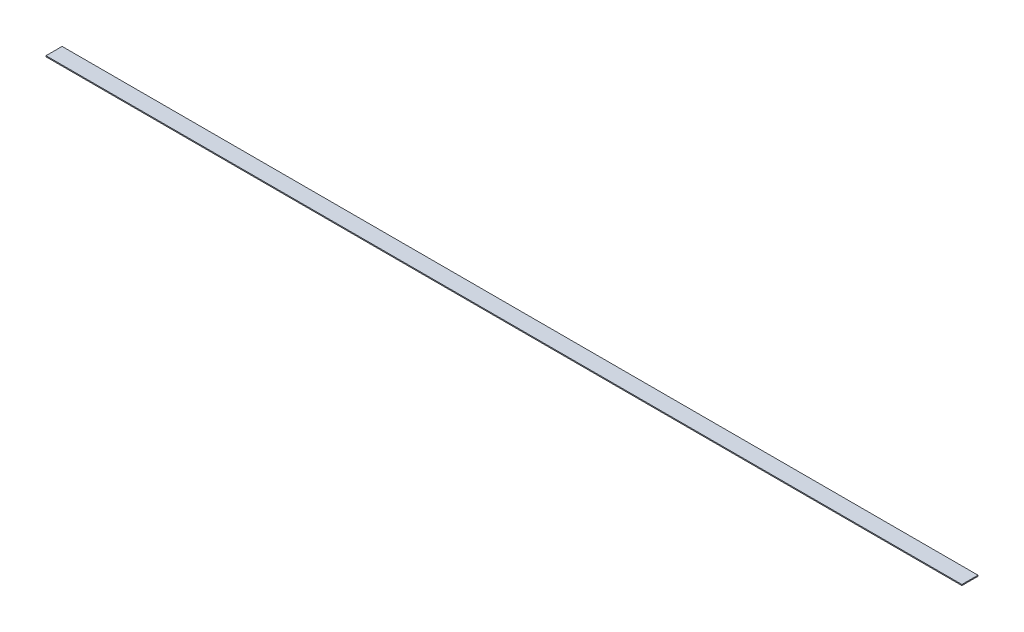
ISO-10303-21;
HEADER;
FILE_DESCRIPTION(('STEP AP214'),'2;1');
FILE_NAME('part.step','',(''),(''),'','','');
FILE_SCHEMA(('AUTOMOTIVE_DESIGN { 1 0 10303 214 1 1 1 1 }'));
ENDSEC;
DATA;
#1=APPLICATION_CONTEXT('core data for automotive mechanical design processes');
#2=APPLICATION_PROTOCOL_DEFINITION('international standard','automotive_design',2000,#1);
#3=PRODUCT_CONTEXT('',#1,'mechanical');
#4=PRODUCT('Part','Part','',(#3));
#5=PRODUCT_RELATED_PRODUCT_CATEGORY('part','',(#4));
#6=PRODUCT_DEFINITION_FORMATION('','',#4);
#7=PRODUCT_DEFINITION_CONTEXT('part definition',#1,'design');
#8=PRODUCT_DEFINITION('design','',#6,#7);
#9=PRODUCT_DEFINITION_SHAPE('','',#8);
#10=(LENGTH_UNIT() NAMED_UNIT(*) SI_UNIT(.MILLI.,.METRE.));
#11=(NAMED_UNIT(*) PLANE_ANGLE_UNIT() SI_UNIT($,.RADIAN.));
#12=(NAMED_UNIT(*) SI_UNIT($,.STERADIAN.) SOLID_ANGLE_UNIT());
#13=UNCERTAINTY_MEASURE_WITH_UNIT(LENGTH_MEASURE(1.E-05),#10,'distance_accuracy_value','');
#14=(GEOMETRIC_REPRESENTATION_CONTEXT(3) GLOBAL_UNCERTAINTY_ASSIGNED_CONTEXT((#13)) GLOBAL_UNIT_ASSIGNED_CONTEXT((#10,
#11,#12)) REPRESENTATION_CONTEXT('',''));
#15=CARTESIAN_POINT('',(0.,0.,0.));
#16=DIRECTION('',(0.,0.,1.));
#17=DIRECTION('',(1.,0.,0.));
#18=AXIS2_PLACEMENT_3D('',#15,#16,#17);
#19=CARTESIAN_POINT('',(-1444.625,3.175,-25.3999999999998));
#20=DIRECTION('',(1.,0.,0.));
#21=DIRECTION('',(0.,0.,-1.));
#22=AXIS2_PLACEMENT_3D('',#19,#20,#21);
#23=PLANE('',#22);
#24=DIRECTION('',(0.,0.,1.));
#25=VECTOR('',#24,1.);
#26=CARTESIAN_POINT('',(-1444.625,0.,-25.3999999999998));
#27=LINE('',#26,#25);
#28=CARTESIAN_POINT('',(-1444.625,0.,-25.3999999999998));
#29=VERTEX_POINT('',#28);
#30=CARTESIAN_POINT('',(-1444.625,0.,25.4000000000002));
#31=VERTEX_POINT('',#30);
#32=EDGE_CURVE('E95',#29,#31,#27,.T.);
#33=ORIENTED_EDGE('',*,*,#32,.T.);
#34=DIRECTION('',(0.,-1.,0.));
#35=VECTOR('',#34,1.);
#36=CARTESIAN_POINT('',(-1444.625,3.175,25.4000000000002));
#37=LINE('',#36,#35);
#38=CARTESIAN_POINT('',(-1444.625,3.175,25.4000000000002));
#39=VERTEX_POINT('',#38);
#40=EDGE_CURVE('E11',#39,#31,#37,.T.);
#41=ORIENTED_EDGE('',*,*,#40,.F.);
#42=DIRECTION('',(0.,0.,1.));
#43=VECTOR('',#42,1.);
#44=CARTESIAN_POINT('',(-1444.625,3.175,-25.3999999999998));
#45=LINE('',#44,#43);
#46=CARTESIAN_POINT('',(-1444.625,3.175,-25.3999999999998));
#47=VERTEX_POINT('',#46);
#48=EDGE_CURVE('E83',#47,#39,#45,.T.);
#49=ORIENTED_EDGE('',*,*,#48,.F.);
#50=DIRECTION('',(0.,-1.,0.));
#51=VECTOR('',#50,1.);
#52=CARTESIAN_POINT('',(-1444.625,3.175,-25.3999999999998));
#53=LINE('',#52,#51);
#54=EDGE_CURVE('E91',#47,#29,#53,.T.);
#55=ORIENTED_EDGE('',*,*,#54,.T.);
#56=EDGE_LOOP('',(#33,#41,#49,#55));
#57=FACE_BOUND('',#56,.T.);
#58=ADVANCED_FACE('F32',(#57),#23,.F.);
#59=CARTESIAN_POINT('',(1444.625,3.175,25.3999999999998));
#60=DIRECTION('',(0.,0.,-1.));
#61=DIRECTION('',(-1.,0.,0.));
#62=AXIS2_PLACEMENT_3D('',#59,#60,#61);
#63=PLANE('',#62);
#64=DIRECTION('',(1.,0.,0.));
#65=VECTOR('',#64,1.);
#66=CARTESIAN_POINT('',(1444.625,0.,25.3999999999998));
#67=LINE('',#66,#65);
#68=CARTESIAN_POINT('',(1444.625,0.,25.3999999999998));
#69=VERTEX_POINT('',#68);
#70=EDGE_CURVE('E87',#31,#69,#67,.T.);
#71=ORIENTED_EDGE('',*,*,#70,.T.);
#72=DIRECTION('',(0.,-1.,0.));
#73=VECTOR('',#72,1.);
#74=CARTESIAN_POINT('',(1444.625,3.175,25.3999999999998));
#75=LINE('',#74,#73);
#76=CARTESIAN_POINT('',(1444.625,3.175,25.3999999999998));
#77=VERTEX_POINT('',#76);
#78=EDGE_CURVE('E40',#77,#69,#75,.T.);
#79=ORIENTED_EDGE('',*,*,#78,.F.);
#80=DIRECTION('',(1.,0.,0.));
#81=VECTOR('',#80,1.);
#82=CARTESIAN_POINT('',(1444.625,3.175,25.3999999999998));
#83=LINE('',#82,#81);
#84=EDGE_CURVE('E78',#39,#77,#83,.T.);
#85=ORIENTED_EDGE('',*,*,#84,.F.);
#86=ORIENTED_EDGE('',*,*,#40,.T.);
#87=EDGE_LOOP('',(#71,#79,#85,#86));
#88=FACE_BOUND('',#87,.T.);
#89=ADVANCED_FACE('F86',(#88),#63,.F.);
#90=CARTESIAN_POINT('',(1444.625,3.175,-25.4000000000002));
#91=DIRECTION('',(-1.,0.,0.));
#92=DIRECTION('',(0.,0.,1.));
#93=AXIS2_PLACEMENT_3D('',#90,#91,#92);
#94=PLANE('',#93);
#95=DIRECTION('',(0.,0.,-1.));
#96=VECTOR('',#95,1.);
#97=CARTESIAN_POINT('',(1444.625,0.,-25.4000000000002));
#98=LINE('',#97,#96);
#99=CARTESIAN_POINT('',(1444.625,0.,-25.4000000000002));
#100=VERTEX_POINT('',#99);
#101=EDGE_CURVE('E65',#69,#100,#98,.T.);
#102=ORIENTED_EDGE('',*,*,#101,.T.);
#103=DIRECTION('',(0.,-1.,0.));
#104=VECTOR('',#103,1.);
#105=CARTESIAN_POINT('',(1444.625,3.175,-25.4000000000002));
#106=LINE('',#105,#104);
#107=CARTESIAN_POINT('',(1444.625,3.175,-25.4000000000002));
#108=VERTEX_POINT('',#107);
#109=EDGE_CURVE('E88',#108,#100,#106,.T.);
#110=ORIENTED_EDGE('',*,*,#109,.F.);
#111=DIRECTION('',(0.,0.,-1.));
#112=VECTOR('',#111,1.);
#113=CARTESIAN_POINT('',(1444.625,3.175,-25.4000000000002));
#114=LINE('',#113,#112);
#115=EDGE_CURVE('E81',#77,#108,#114,.T.);
#116=ORIENTED_EDGE('',*,*,#115,.F.);
#117=ORIENTED_EDGE('',*,*,#78,.T.);
#118=EDGE_LOOP('',(#102,#110,#116,#117));
#119=FACE_BOUND('',#118,.T.);
#120=ADVANCED_FACE('F89',(#119),#94,.F.);
#121=CARTESIAN_POINT('',(1444.625,3.175,-25.4000000000002));
#122=DIRECTION('',(0.,0.,1.));
#123=DIRECTION('',(1.,0.,0.));
#124=AXIS2_PLACEMENT_3D('',#121,#122,#123);
#125=PLANE('',#124);
#126=DIRECTION('',(-1.,0.,0.));
#127=VECTOR('',#126,1.);
#128=CARTESIAN_POINT('',(1444.625,0.,-25.4000000000002));
#129=LINE('',#128,#127);
#130=EDGE_CURVE('E71',#100,#29,#129,.T.);
#131=ORIENTED_EDGE('',*,*,#130,.T.);
#132=ORIENTED_EDGE('',*,*,#54,.F.);
#133=DIRECTION('',(-1.,0.,0.));
#134=VECTOR('',#133,1.);
#135=CARTESIAN_POINT('',(1444.625,3.175,-25.4000000000002));
#136=LINE('',#135,#134);
#137=EDGE_CURVE('E48',#108,#47,#136,.T.);
#138=ORIENTED_EDGE('',*,*,#137,.F.);
#139=ORIENTED_EDGE('',*,*,#109,.T.);
#140=EDGE_LOOP('',(#131,#132,#138,#139));
#141=FACE_BOUND('',#140,.T.);
#142=ADVANCED_FACE('F102',(#141),#125,.F.);
#143=CARTESIAN_POINT('',(0.,3.175,0.));
#144=DIRECTION('',(0.,-1.,0.));
#145=DIRECTION('',(0.,0.,-1.));
#146=AXIS2_PLACEMENT_3D('',#143,#144,#145);
#147=PLANE('',#146);
#148=ORIENTED_EDGE('',*,*,#48,.T.);
#149=ORIENTED_EDGE('',*,*,#84,.T.);
#150=ORIENTED_EDGE('',*,*,#115,.T.);
#151=ORIENTED_EDGE('',*,*,#137,.T.);
#152=EDGE_LOOP('',(#148,#149,#150,#151));
#153=FACE_BOUND('',#152,.T.);
#154=ADVANCED_FACE('F79',(#153),#147,.F.);
#155=CARTESIAN_POINT('',(0.,0.,0.));
#156=DIRECTION('',(0.,-1.,0.));
#157=DIRECTION('',(0.,0.,-1.));
#158=AXIS2_PLACEMENT_3D('',#155,#156,#157);
#159=PLANE('',#158);
#160=ORIENTED_EDGE('',*,*,#32,.F.);
#161=ORIENTED_EDGE('',*,*,#130,.F.);
#162=ORIENTED_EDGE('',*,*,#101,.F.);
#163=ORIENTED_EDGE('',*,*,#70,.F.);
#164=EDGE_LOOP('',(#160,#161,#162,#163));
#165=FACE_BOUND('',#164,.T.);
#166=ADVANCED_FACE('F105',(#165),#159,.T.);
#167=CLOSED_SHELL('',(#58,#89,#120,#142,#154,#166));
#168=MANIFOLD_SOLID_BREP('B2',#167);
#169=ADVANCED_BREP_SHAPE_REPRESENTATION('',(#18,#168),#14);
#170=SHAPE_DEFINITION_REPRESENTATION(#9,#169);
ENDSEC;
END-ISO-10303-21;
